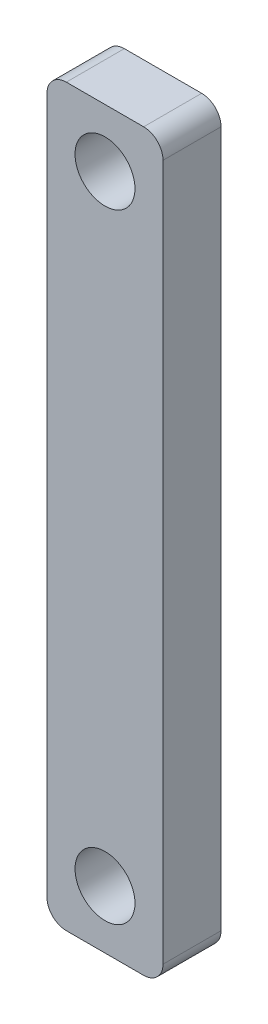
ISO-10303-21;
HEADER;
FILE_DESCRIPTION(('STEP AP214'),'2;1');
FILE_NAME('part.step','',(''),(''),'','','');
FILE_SCHEMA(('AUTOMOTIVE_DESIGN { 1 0 10303 214 1 1 1 1 }'));
ENDSEC;
DATA;
#1=APPLICATION_CONTEXT('core data for automotive mechanical design processes');
#2=APPLICATION_PROTOCOL_DEFINITION('international standard','automotive_design',2000,#1);
#3=PRODUCT_CONTEXT('',#1,'mechanical');
#4=PRODUCT('Part','Part','',(#3));
#5=PRODUCT_RELATED_PRODUCT_CATEGORY('part','',(#4));
#6=PRODUCT_DEFINITION_FORMATION('','',#4);
#7=PRODUCT_DEFINITION_CONTEXT('part definition',#1,'design');
#8=PRODUCT_DEFINITION('design','',#6,#7);
#9=PRODUCT_DEFINITION_SHAPE('','',#8);
#10=(LENGTH_UNIT() NAMED_UNIT(*) SI_UNIT(.MILLI.,.METRE.));
#11=(NAMED_UNIT(*) PLANE_ANGLE_UNIT() SI_UNIT($,.RADIAN.));
#12=(NAMED_UNIT(*) SI_UNIT($,.STERADIAN.) SOLID_ANGLE_UNIT());
#13=UNCERTAINTY_MEASURE_WITH_UNIT(LENGTH_MEASURE(1.E-05),#10,'distance_accuracy_value','');
#14=(GEOMETRIC_REPRESENTATION_CONTEXT(3) GLOBAL_UNCERTAINTY_ASSIGNED_CONTEXT((#13)) GLOBAL_UNIT_ASSIGNED_CONTEXT((#10,
#11,#12)) REPRESENTATION_CONTEXT('',''));
#15=CARTESIAN_POINT('',(0.,0.,0.));
#16=DIRECTION('',(0.,0.,1.));
#17=DIRECTION('',(1.,0.,0.));
#18=AXIS2_PLACEMENT_3D('',#15,#16,#17);
#19=CARTESIAN_POINT('',(0.,0.,3.));
#20=DIRECTION('',(0.,0.,-1.));
#21=DIRECTION('',(-1.,0.,0.));
#22=AXIS2_PLACEMENT_3D('',#19,#20,#21);
#23=PLANE('',#22);
#24=DIRECTION('',(0.,-1.,0.));
#25=VECTOR('',#24,1.);
#26=CARTESIAN_POINT('',(-3.,-19.,3.));
#27=LINE('',#26,#25);
#28=CARTESIAN_POINT('',(-3.,18.,3.));
#29=VERTEX_POINT('',#28);
#30=CARTESIAN_POINT('',(-3.,-18.,3.));
#31=VERTEX_POINT('',#30);
#32=EDGE_CURVE('E168',#29,#31,#27,.T.);
#33=ORIENTED_EDGE('',*,*,#32,.T.);
#34=CARTESIAN_POINT('',(-2.,-18.,3.));
#35=DIRECTION('',(0.,0.,-1.));
#36=DIRECTION('',(-1.,0.,0.));
#37=AXIS2_PLACEMENT_3D('',#34,#35,#36);
#38=CIRCLE('',#37,1.);
#39=CARTESIAN_POINT('',(-2.,-19.,3.));
#40=VERTEX_POINT('',#39);
#41=EDGE_CURVE('E151',#31,#40,#38,.F.);
#42=ORIENTED_EDGE('',*,*,#41,.T.);
#43=DIRECTION('',(1.,0.,0.));
#44=VECTOR('',#43,1.);
#45=CARTESIAN_POINT('',(-3.,-19.,3.));
#46=LINE('',#45,#44);
#47=CARTESIAN_POINT('',(2.,-19.,3.));
#48=VERTEX_POINT('',#47);
#49=EDGE_CURVE('E122',#40,#48,#46,.T.);
#50=ORIENTED_EDGE('',*,*,#49,.T.);
#51=CARTESIAN_POINT('',(2.,-18.,3.));
#52=DIRECTION('',(0.,0.,-1.));
#53=DIRECTION('',(-1.,0.,0.));
#54=AXIS2_PLACEMENT_3D('',#51,#52,#53);
#55=CIRCLE('',#54,1.);
#56=CARTESIAN_POINT('',(3.,-18.,3.));
#57=VERTEX_POINT('',#56);
#58=EDGE_CURVE('E149',#48,#57,#55,.F.);
#59=ORIENTED_EDGE('',*,*,#58,.T.);
#60=DIRECTION('',(0.,1.,0.));
#61=VECTOR('',#60,1.);
#62=CARTESIAN_POINT('',(3.,-19.,3.));
#63=LINE('',#62,#61);
#64=CARTESIAN_POINT('',(3.,18.,3.));
#65=VERTEX_POINT('',#64);
#66=EDGE_CURVE('E129',#57,#65,#63,.T.);
#67=ORIENTED_EDGE('',*,*,#66,.T.);
#68=CARTESIAN_POINT('',(2.,18.,3.));
#69=DIRECTION('',(0.,0.,-1.));
#70=DIRECTION('',(-1.,0.,0.));
#71=AXIS2_PLACEMENT_3D('',#68,#69,#70);
#72=CIRCLE('',#71,1.);
#73=CARTESIAN_POINT('',(2.,19.,3.));
#74=VERTEX_POINT('',#73);
#75=EDGE_CURVE('E57',#65,#74,#72,.F.);
#76=ORIENTED_EDGE('',*,*,#75,.T.);
#77=DIRECTION('',(-1.,0.,0.));
#78=VECTOR('',#77,1.);
#79=CARTESIAN_POINT('',(-3.,19.,3.));
#80=LINE('',#79,#78);
#81=CARTESIAN_POINT('',(-2.,19.,3.));
#82=VERTEX_POINT('',#81);
#83=EDGE_CURVE('E132',#74,#82,#80,.T.);
#84=ORIENTED_EDGE('',*,*,#83,.T.);
#85=CARTESIAN_POINT('',(-2.,18.,3.));
#86=DIRECTION('',(0.,0.,-1.));
#87=DIRECTION('',(-1.,0.,0.));
#88=AXIS2_PLACEMENT_3D('',#85,#86,#87);
#89=CIRCLE('',#88,1.);
#90=EDGE_CURVE('E147',#82,#29,#89,.F.);
#91=ORIENTED_EDGE('',*,*,#90,.T.);
#92=EDGE_LOOP('',(#33,#42,#50,#59,#67,#76,#84,#91));
#93=FACE_BOUND('',#92,.T.);
#94=CARTESIAN_POINT('',(0.,16.,3.));
#95=DIRECTION('',(0.,0.,1.));
#96=DIRECTION('',(1.,0.,0.));
#97=AXIS2_PLACEMENT_3D('',#94,#95,#96);
#98=CIRCLE('',#97,1.55);
#99=CARTESIAN_POINT('',(1.55,16.,3.));
#100=VERTEX_POINT('',#99);
#101=EDGE_CURVE('E164',#100,#100,#98,.T.);
#102=ORIENTED_EDGE('',*,*,#101,.F.);
#103=EDGE_LOOP('',(#102));
#104=FACE_BOUND('',#103,.T.);
#105=CARTESIAN_POINT('',(0.,-16.,3.));
#106=DIRECTION('',(0.,0.,1.));
#107=DIRECTION('',(1.,0.,0.));
#108=AXIS2_PLACEMENT_3D('',#105,#106,#107);
#109=CIRCLE('',#108,1.55);
#110=CARTESIAN_POINT('',(1.55,-16.,3.));
#111=VERTEX_POINT('',#110);
#112=EDGE_CURVE('E175',#111,#111,#109,.T.);
#113=ORIENTED_EDGE('',*,*,#112,.F.);
#114=EDGE_LOOP('',(#113));
#115=FACE_BOUND('',#114,.T.);
#116=ADVANCED_FACE('F37',(#93,#104,#115),#23,.F.);
#117=CARTESIAN_POINT('',(0.,0.,0.));
#118=DIRECTION('',(0.,0.,-1.));
#119=DIRECTION('',(-1.,0.,0.));
#120=AXIS2_PLACEMENT_3D('',#117,#118,#119);
#121=PLANE('',#120);
#122=CARTESIAN_POINT('',(0.,16.,0.));
#123=DIRECTION('',(0.,0.,1.));
#124=DIRECTION('',(1.,0.,0.));
#125=AXIS2_PLACEMENT_3D('',#122,#123,#124);
#126=CIRCLE('',#125,1.55);
#127=CARTESIAN_POINT('',(1.55,16.,0.));
#128=VERTEX_POINT('',#127);
#129=EDGE_CURVE('E172',#128,#128,#126,.T.);
#130=ORIENTED_EDGE('',*,*,#129,.T.);
#131=EDGE_LOOP('',(#130));
#132=FACE_BOUND('',#131,.T.);
#133=DIRECTION('',(1.,0.,0.));
#134=VECTOR('',#133,1.);
#135=CARTESIAN_POINT('',(-3.,-19.,0.));
#136=LINE('',#135,#134);
#137=CARTESIAN_POINT('',(-2.,-19.,0.));
#138=VERTEX_POINT('',#137);
#139=CARTESIAN_POINT('',(2.,-19.,0.));
#140=VERTEX_POINT('',#139);
#141=EDGE_CURVE('E119',#138,#140,#136,.T.);
#142=ORIENTED_EDGE('',*,*,#141,.F.);
#143=CARTESIAN_POINT('',(-2.,-18.,0.));
#144=DIRECTION('',(0.,0.,-1.));
#145=DIRECTION('',(-1.,0.,0.));
#146=AXIS2_PLACEMENT_3D('',#143,#144,#145);
#147=CIRCLE('',#146,1.);
#148=CARTESIAN_POINT('',(-3.,-18.,0.));
#149=VERTEX_POINT('',#148);
#150=EDGE_CURVE('E102',#138,#149,#147,.T.);
#151=ORIENTED_EDGE('',*,*,#150,.T.);
#152=DIRECTION('',(0.,-1.,0.));
#153=VECTOR('',#152,1.);
#154=CARTESIAN_POINT('',(-3.,-19.,0.));
#155=LINE('',#154,#153);
#156=CARTESIAN_POINT('',(-3.,18.,0.));
#157=VERTEX_POINT('',#156);
#158=EDGE_CURVE('E130',#157,#149,#155,.T.);
#159=ORIENTED_EDGE('',*,*,#158,.F.);
#160=CARTESIAN_POINT('',(-2.,18.,0.));
#161=DIRECTION('',(0.,0.,-1.));
#162=DIRECTION('',(-1.,0.,0.));
#163=AXIS2_PLACEMENT_3D('',#160,#161,#162);
#164=CIRCLE('',#163,1.);
#165=CARTESIAN_POINT('',(-2.,19.,0.));
#166=VERTEX_POINT('',#165);
#167=EDGE_CURVE('E140',#157,#166,#164,.T.);
#168=ORIENTED_EDGE('',*,*,#167,.T.);
#169=DIRECTION('',(-1.,0.,0.));
#170=VECTOR('',#169,1.);
#171=CARTESIAN_POINT('',(-3.,19.,0.));
#172=LINE('',#171,#170);
#173=CARTESIAN_POINT('',(2.,19.,0.));
#174=VERTEX_POINT('',#173);
#175=EDGE_CURVE('E134',#174,#166,#172,.T.);
#176=ORIENTED_EDGE('',*,*,#175,.F.);
#177=CARTESIAN_POINT('',(2.,18.,0.));
#178=DIRECTION('',(0.,0.,-1.));
#179=DIRECTION('',(-1.,0.,0.));
#180=AXIS2_PLACEMENT_3D('',#177,#178,#179);
#181=CIRCLE('',#180,1.);
#182=CARTESIAN_POINT('',(3.,18.,0.));
#183=VERTEX_POINT('',#182);
#184=EDGE_CURVE('E123',#174,#183,#181,.T.);
#185=ORIENTED_EDGE('',*,*,#184,.T.);
#186=DIRECTION('',(0.,1.,0.));
#187=VECTOR('',#186,1.);
#188=CARTESIAN_POINT('',(3.,-19.,0.));
#189=LINE('',#188,#187);
#190=CARTESIAN_POINT('',(3.,-18.,0.));
#191=VERTEX_POINT('',#190);
#192=EDGE_CURVE('E163',#191,#183,#189,.T.);
#193=ORIENTED_EDGE('',*,*,#192,.F.);
#194=CARTESIAN_POINT('',(2.,-18.,0.));
#195=DIRECTION('',(0.,0.,-1.));
#196=DIRECTION('',(-1.,0.,0.));
#197=AXIS2_PLACEMENT_3D('',#194,#195,#196);
#198=CIRCLE('',#197,1.);
#199=EDGE_CURVE('E113',#191,#140,#198,.T.);
#200=ORIENTED_EDGE('',*,*,#199,.T.);
#201=EDGE_LOOP('',(#142,#151,#159,#168,#176,#185,#193,#200));
#202=FACE_BOUND('',#201,.T.);
#203=CARTESIAN_POINT('',(0.,-16.,0.));
#204=DIRECTION('',(0.,0.,1.));
#205=DIRECTION('',(1.,0.,0.));
#206=AXIS2_PLACEMENT_3D('',#203,#204,#205);
#207=CIRCLE('',#206,1.55);
#208=CARTESIAN_POINT('',(1.55,-16.,0.));
#209=VERTEX_POINT('',#208);
#210=EDGE_CURVE('E178',#209,#209,#207,.T.);
#211=ORIENTED_EDGE('',*,*,#210,.T.);
#212=EDGE_LOOP('',(#211));
#213=FACE_BOUND('',#212,.T.);
#214=ADVANCED_FACE('F126',(#132,#202,#213),#121,.T.);
#215=CARTESIAN_POINT('',(3.,-19.,3.));
#216=DIRECTION('',(-1.,0.,0.));
#217=DIRECTION('',(0.,-1.,0.));
#218=AXIS2_PLACEMENT_3D('',#215,#216,#217);
#219=PLANE('',#218);
#220=ORIENTED_EDGE('',*,*,#66,.F.);
#221=DIRECTION('',(0.,0.,-1.));
#222=VECTOR('',#221,1.);
#223=CARTESIAN_POINT('',(3.,-18.,3.));
#224=LINE('',#223,#222);
#225=EDGE_CURVE('E155',#57,#191,#224,.T.);
#226=ORIENTED_EDGE('',*,*,#225,.T.);
#227=ORIENTED_EDGE('',*,*,#192,.T.);
#228=DIRECTION('',(0.,0.,-1.));
#229=VECTOR('',#228,1.);
#230=CARTESIAN_POINT('',(3.,18.,3.));
#231=LINE('',#230,#229);
#232=EDGE_CURVE('E153',#183,#65,#231,.F.);
#233=ORIENTED_EDGE('',*,*,#232,.T.);
#234=EDGE_LOOP('',(#220,#226,#227,#233));
#235=FACE_BOUND('',#234,.T.);
#236=ADVANCED_FACE('F192',(#235),#219,.F.);
#237=CARTESIAN_POINT('',(-3.,19.,3.));
#238=DIRECTION('',(0.,-1.,0.));
#239=DIRECTION('',(0.,0.,-1.));
#240=AXIS2_PLACEMENT_3D('',#237,#238,#239);
#241=PLANE('',#240);
#242=ORIENTED_EDGE('',*,*,#175,.T.);
#243=DIRECTION('',(0.,0.,-1.));
#244=VECTOR('',#243,1.);
#245=CARTESIAN_POINT('',(-2.,19.,3.));
#246=LINE('',#245,#244);
#247=EDGE_CURVE('E11',#166,#82,#246,.F.);
#248=ORIENTED_EDGE('',*,*,#247,.T.);
#249=ORIENTED_EDGE('',*,*,#83,.F.);
#250=DIRECTION('',(0.,0.,-1.));
#251=VECTOR('',#250,1.);
#252=CARTESIAN_POINT('',(2.,19.,3.));
#253=LINE('',#252,#251);
#254=EDGE_CURVE('E45',#74,#174,#253,.T.);
#255=ORIENTED_EDGE('',*,*,#254,.T.);
#256=EDGE_LOOP('',(#242,#248,#249,#255));
#257=FACE_BOUND('',#256,.T.);
#258=ADVANCED_FACE('F160',(#257),#241,.F.);
#259=CARTESIAN_POINT('',(-3.,-19.,3.));
#260=DIRECTION('',(1.,0.,0.));
#261=DIRECTION('',(0.,1.,0.));
#262=AXIS2_PLACEMENT_3D('',#259,#260,#261);
#263=PLANE('',#262);
#264=ORIENTED_EDGE('',*,*,#158,.T.);
#265=DIRECTION('',(0.,0.,-1.));
#266=VECTOR('',#265,1.);
#267=CARTESIAN_POINT('',(-3.,-18.,3.));
#268=LINE('',#267,#266);
#269=EDGE_CURVE('E107',#149,#31,#268,.F.);
#270=ORIENTED_EDGE('',*,*,#269,.T.);
#271=ORIENTED_EDGE('',*,*,#32,.F.);
#272=DIRECTION('',(0.,0.,-1.));
#273=VECTOR('',#272,1.);
#274=CARTESIAN_POINT('',(-3.,18.,3.));
#275=LINE('',#274,#273);
#276=EDGE_CURVE('E112',#29,#157,#275,.T.);
#277=ORIENTED_EDGE('',*,*,#276,.T.);
#278=EDGE_LOOP('',(#264,#270,#271,#277));
#279=FACE_BOUND('',#278,.T.);
#280=ADVANCED_FACE('F202',(#279),#263,.F.);
#281=CARTESIAN_POINT('',(-3.,-19.,3.));
#282=DIRECTION('',(0.,1.,0.));
#283=DIRECTION('',(0.,0.,1.));
#284=AXIS2_PLACEMENT_3D('',#281,#282,#283);
#285=PLANE('',#284);
#286=ORIENTED_EDGE('',*,*,#49,.F.);
#287=DIRECTION('',(0.,0.,-1.));
#288=VECTOR('',#287,1.);
#289=CARTESIAN_POINT('',(-2.,-19.,3.));
#290=LINE('',#289,#288);
#291=EDGE_CURVE('E106',#40,#138,#290,.T.);
#292=ORIENTED_EDGE('',*,*,#291,.T.);
#293=ORIENTED_EDGE('',*,*,#141,.T.);
#294=DIRECTION('',(0.,0.,-1.));
#295=VECTOR('',#294,1.);
#296=CARTESIAN_POINT('',(2.,-19.,3.));
#297=LINE('',#296,#295);
#298=EDGE_CURVE('E124',#140,#48,#297,.F.);
#299=ORIENTED_EDGE('',*,*,#298,.T.);
#300=EDGE_LOOP('',(#286,#292,#293,#299));
#301=FACE_BOUND('',#300,.T.);
#302=ADVANCED_FACE('F118',(#301),#285,.F.);
#303=CARTESIAN_POINT('',(0.,16.,3.));
#304=DIRECTION('',(0.,0.,-1.));
#305=DIRECTION('',(-1.,0.,0.));
#306=AXIS2_PLACEMENT_3D('',#303,#304,#305);
#307=CYLINDRICAL_SURFACE('',#306,1.55);
#308=ORIENTED_EDGE('',*,*,#101,.T.);
#309=EDGE_LOOP('',(#308));
#310=FACE_BOUND('',#309,.T.);
#311=ORIENTED_EDGE('',*,*,#129,.F.);
#312=EDGE_LOOP('',(#311));
#313=FACE_BOUND('',#312,.T.);
#314=ADVANCED_FACE('F197',(#310,#313),#307,.F.);
#315=CARTESIAN_POINT('',(0.,-16.,3.));
#316=DIRECTION('',(0.,0.,-1.));
#317=DIRECTION('',(-1.,0.,0.));
#318=AXIS2_PLACEMENT_3D('',#315,#316,#317);
#319=CYLINDRICAL_SURFACE('',#318,1.55);
#320=ORIENTED_EDGE('',*,*,#112,.T.);
#321=EDGE_LOOP('',(#320));
#322=FACE_BOUND('',#321,.T.);
#323=ORIENTED_EDGE('',*,*,#210,.F.);
#324=EDGE_LOOP('',(#323));
#325=FACE_BOUND('',#324,.T.);
#326=ADVANCED_FACE('F184',(#322,#325),#319,.F.);
#327=CARTESIAN_POINT('',(-2.,-18.,3.));
#328=DIRECTION('',(0.,0.,-1.));
#329=DIRECTION('',(-1.,0.,0.));
#330=AXIS2_PLACEMENT_3D('',#327,#328,#329);
#331=CYLINDRICAL_SURFACE('',#330,1.);
#332=ORIENTED_EDGE('',*,*,#41,.F.);
#333=ORIENTED_EDGE('',*,*,#269,.F.);
#334=ORIENTED_EDGE('',*,*,#150,.F.);
#335=ORIENTED_EDGE('',*,*,#291,.F.);
#336=EDGE_LOOP('',(#332,#333,#334,#335));
#337=FACE_BOUND('',#336,.T.);
#338=ADVANCED_FACE('F105',(#337),#331,.T.);
#339=CARTESIAN_POINT('',(2.,-18.,3.));
#340=DIRECTION('',(0.,0.,-1.));
#341=DIRECTION('',(-1.,0.,0.));
#342=AXIS2_PLACEMENT_3D('',#339,#340,#341);
#343=CYLINDRICAL_SURFACE('',#342,1.);
#344=ORIENTED_EDGE('',*,*,#58,.F.);
#345=ORIENTED_EDGE('',*,*,#298,.F.);
#346=ORIENTED_EDGE('',*,*,#199,.F.);
#347=ORIENTED_EDGE('',*,*,#225,.F.);
#348=EDGE_LOOP('',(#344,#345,#346,#347));
#349=FACE_BOUND('',#348,.T.);
#350=ADVANCED_FACE('F213',(#349),#343,.T.);
#351=CARTESIAN_POINT('',(-2.,18.,3.));
#352=DIRECTION('',(0.,0.,-1.));
#353=DIRECTION('',(-1.,0.,0.));
#354=AXIS2_PLACEMENT_3D('',#351,#352,#353);
#355=CYLINDRICAL_SURFACE('',#354,1.);
#356=ORIENTED_EDGE('',*,*,#90,.F.);
#357=ORIENTED_EDGE('',*,*,#247,.F.);
#358=ORIENTED_EDGE('',*,*,#167,.F.);
#359=ORIENTED_EDGE('',*,*,#276,.F.);
#360=EDGE_LOOP('',(#356,#357,#358,#359));
#361=FACE_BOUND('',#360,.T.);
#362=ADVANCED_FACE('F215',(#361),#355,.T.);
#363=CARTESIAN_POINT('',(2.,18.,3.));
#364=DIRECTION('',(0.,0.,-1.));
#365=DIRECTION('',(-1.,0.,0.));
#366=AXIS2_PLACEMENT_3D('',#363,#364,#365);
#367=CYLINDRICAL_SURFACE('',#366,1.);
#368=ORIENTED_EDGE('',*,*,#75,.F.);
#369=ORIENTED_EDGE('',*,*,#232,.F.);
#370=ORIENTED_EDGE('',*,*,#184,.F.);
#371=ORIENTED_EDGE('',*,*,#254,.F.);
#372=EDGE_LOOP('',(#368,#369,#370,#371));
#373=FACE_BOUND('',#372,.T.);
#374=ADVANCED_FACE('F39',(#373),#367,.T.);
#375=CLOSED_SHELL('',(#116,#214,#236,#258,#280,#302,#314,#326,#338,#350,#362,#374));
#376=MANIFOLD_SOLID_BREP('B2',#375);
#377=ADVANCED_BREP_SHAPE_REPRESENTATION('',(#18,#376),#14);
#378=SHAPE_DEFINITION_REPRESENTATION(#9,#377);
ENDSEC;
END-ISO-10303-21;
